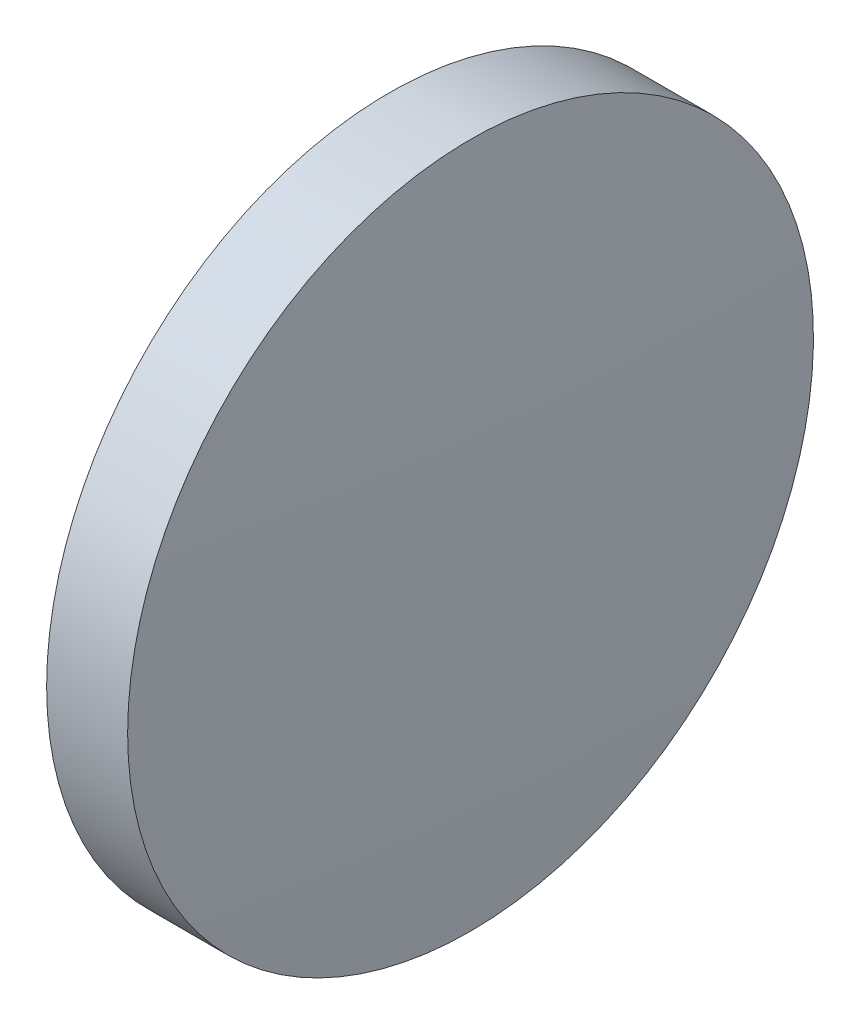
ISO-10303-21;
HEADER;
FILE_DESCRIPTION(('STEP AP214'),'2;1');
FILE_NAME('part.step','',(''),(''),'','','');
FILE_SCHEMA(('AUTOMOTIVE_DESIGN { 1 0 10303 214 1 1 1 1 }'));
ENDSEC;
DATA;
#1=APPLICATION_CONTEXT('core data for automotive mechanical design processes');
#2=APPLICATION_PROTOCOL_DEFINITION('international standard','automotive_design',2000,#1);
#3=PRODUCT_CONTEXT('',#1,'mechanical');
#4=PRODUCT('Part','Part','',(#3));
#5=PRODUCT_RELATED_PRODUCT_CATEGORY('part','',(#4));
#6=PRODUCT_DEFINITION_FORMATION('','',#4);
#7=PRODUCT_DEFINITION_CONTEXT('part definition',#1,'design');
#8=PRODUCT_DEFINITION('design','',#6,#7);
#9=PRODUCT_DEFINITION_SHAPE('','',#8);
#10=(LENGTH_UNIT() NAMED_UNIT(*) SI_UNIT(.MILLI.,.METRE.));
#11=(NAMED_UNIT(*) PLANE_ANGLE_UNIT() SI_UNIT($,.RADIAN.));
#12=(NAMED_UNIT(*) SI_UNIT($,.STERADIAN.) SOLID_ANGLE_UNIT());
#13=UNCERTAINTY_MEASURE_WITH_UNIT(LENGTH_MEASURE(1.E-05),#10,'distance_accuracy_value','');
#14=(GEOMETRIC_REPRESENTATION_CONTEXT(3) GLOBAL_UNCERTAINTY_ASSIGNED_CONTEXT((#13)) GLOBAL_UNIT_ASSIGNED_CONTEXT((#10,
#11,#12)) REPRESENTATION_CONTEXT('',''));
#15=CARTESIAN_POINT('',(0.,0.,0.));
#16=DIRECTION('',(0.,0.,1.));
#17=DIRECTION('',(1.,0.,0.));
#18=AXIS2_PLACEMENT_3D('',#15,#16,#17);
#19=CARTESIAN_POINT('',(-110.374393569162,65.2335549264125,0.));
#20=DIRECTION('',(-1.,0.,0.));
#21=DIRECTION('',(0.,-1.,0.));
#22=AXIS2_PLACEMENT_3D('',#19,#20,#21);
#23=SPHERICAL_SURFACE('',#22,229.5);
#24=CARTESIAN_POINT('',(118.773942667434,65.2335549264122,0.));
#25=DIRECTION('',(-1.,0.,0.));
#26=DIRECTION('',(0.,0.,1.));
#27=AXIS2_PLACEMENT_3D('',#24,#25,#26);
#28=CIRCLE('',#27,12.7);
#29=CARTESIAN_POINT('',(118.773942667434,65.2335549264122,12.7));
#30=VERTEX_POINT('',#29);
#31=EDGE_CURVE('E10',#30,#30,#28,.T.);
#32=ORIENTED_EDGE('',*,*,#31,.F.);
#33=EDGE_LOOP('',(#32));
#34=FACE_BOUND('',#33,.T.);
#35=ADVANCED_FACE('F35',(#34),#23,.T.);
#36=CARTESIAN_POINT('',(110.165373228488,65.2335549264122,0.));
#37=DIRECTION('',(-1.,0.,0.));
#38=DIRECTION('',(0.,0.,1.));
#39=AXIS2_PLACEMENT_3D('',#36,#37,#38);
#40=CYLINDRICAL_SURFACE('',#39,12.7);
#41=CARTESIAN_POINT('',(115.773606430838,65.2335549264122,0.));
#42=DIRECTION('',(-1.,0.,0.));
#43=DIRECTION('',(0.,0.,1.));
#44=AXIS2_PLACEMENT_3D('',#41,#42,#43);
#45=CIRCLE('',#44,12.7);
#46=CARTESIAN_POINT('',(115.773606430838,65.2335549264122,12.7));
#47=VERTEX_POINT('',#46);
#48=EDGE_CURVE('E41',#47,#47,#45,.T.);
#49=ORIENTED_EDGE('',*,*,#48,.F.);
#50=EDGE_LOOP('',(#49));
#51=FACE_BOUND('',#50,.T.);
#52=ORIENTED_EDGE('',*,*,#31,.T.);
#53=EDGE_LOOP('',(#52));
#54=FACE_BOUND('',#53,.T.);
#55=ADVANCED_FACE('F49',(#51,#54),#40,.T.);
#56=CARTESIAN_POINT('',(115.773606430838,65.2335549264122,0.));
#57=DIRECTION('',(1.,0.,0.));
#58=DIRECTION('',(0.,0.,-1.));
#59=AXIS2_PLACEMENT_3D('',#56,#57,#58);
#60=PLANE('',#59);
#61=ORIENTED_EDGE('',*,*,#48,.T.);
#62=EDGE_LOOP('',(#61));
#63=FACE_BOUND('',#62,.T.);
#64=ADVANCED_FACE('F47',(#63),#60,.F.);
#65=CLOSED_SHELL('',(#35,#55,#64));
#66=MANIFOLD_SOLID_BREP('B2',#65);
#67=ADVANCED_BREP_SHAPE_REPRESENTATION('',(#18,#66),#14);
#68=SHAPE_DEFINITION_REPRESENTATION(#9,#67);
ENDSEC;
END-ISO-10303-21;
